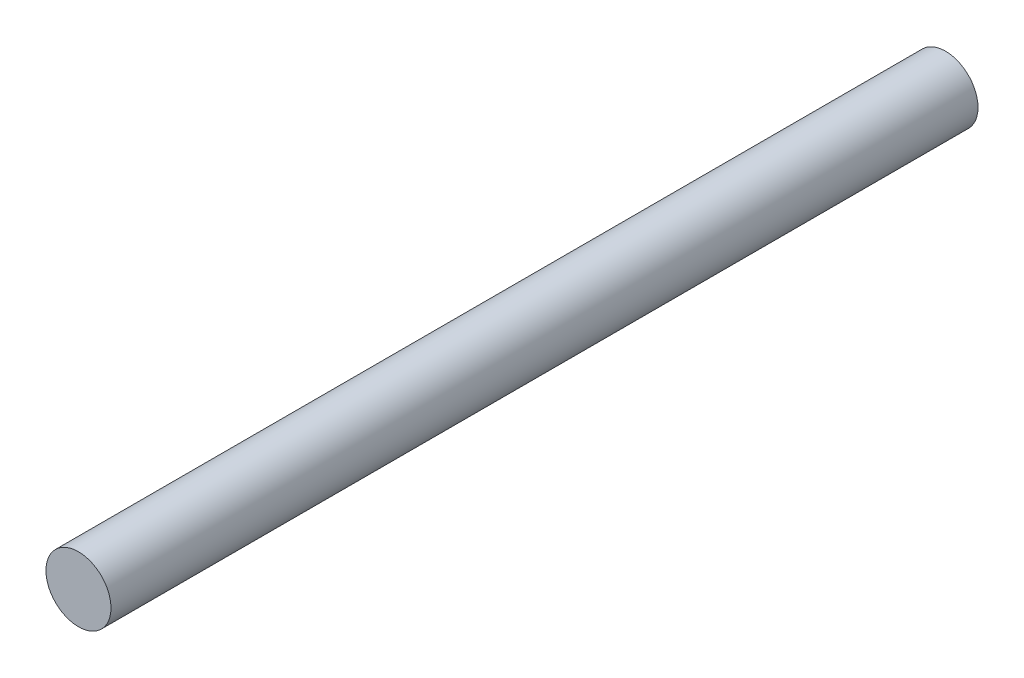
ISO-10303-21;
HEADER;
FILE_DESCRIPTION(('STEP AP214'),'2;1');
FILE_NAME('part.step','',(''),(''),'','','');
FILE_SCHEMA(('AUTOMOTIVE_DESIGN { 1 0 10303 214 1 1 1 1 }'));
ENDSEC;
DATA;
#1=APPLICATION_CONTEXT('core data for automotive mechanical design processes');
#2=APPLICATION_PROTOCOL_DEFINITION('international standard','automotive_design',2000,#1);
#3=PRODUCT_CONTEXT('',#1,'mechanical');
#4=PRODUCT('Part','Part','',(#3));
#5=PRODUCT_RELATED_PRODUCT_CATEGORY('part','',(#4));
#6=PRODUCT_DEFINITION_FORMATION('','',#4);
#7=PRODUCT_DEFINITION_CONTEXT('part definition',#1,'design');
#8=PRODUCT_DEFINITION('design','',#6,#7);
#9=PRODUCT_DEFINITION_SHAPE('','',#8);
#10=(LENGTH_UNIT() NAMED_UNIT(*) SI_UNIT(.MILLI.,.METRE.));
#11=(NAMED_UNIT(*) PLANE_ANGLE_UNIT() SI_UNIT($,.RADIAN.));
#12=(NAMED_UNIT(*) SI_UNIT($,.STERADIAN.) SOLID_ANGLE_UNIT());
#13=UNCERTAINTY_MEASURE_WITH_UNIT(LENGTH_MEASURE(1.E-05),#10,'distance_accuracy_value','');
#14=(GEOMETRIC_REPRESENTATION_CONTEXT(3) GLOBAL_UNCERTAINTY_ASSIGNED_CONTEXT((#13)) GLOBAL_UNIT_ASSIGNED_CONTEXT((#10,
#11,#12)) REPRESENTATION_CONTEXT('',''));
#15=CARTESIAN_POINT('',(0.,0.,0.));
#16=DIRECTION('',(0.,0.,1.));
#17=DIRECTION('',(1.,0.,0.));
#18=AXIS2_PLACEMENT_3D('',#15,#16,#17);
#19=CARTESIAN_POINT('',(0.,0.,120.));
#20=DIRECTION('',(0.,0.,-1.));
#21=DIRECTION('',(-1.,0.,0.));
#22=AXIS2_PLACEMENT_3D('',#19,#20,#21);
#23=CYLINDRICAL_SURFACE('',#22,4.5);
#24=CARTESIAN_POINT('',(0.,0.,120.));
#25=DIRECTION('',(0.,0.,1.));
#26=DIRECTION('',(1.,0.,0.));
#27=AXIS2_PLACEMENT_3D('',#24,#25,#26);
#28=CIRCLE('',#27,4.5);
#29=CARTESIAN_POINT('',(4.5,0.,120.));
#30=VERTEX_POINT('',#29);
#31=EDGE_CURVE('E10',#30,#30,#28,.T.);
#32=ORIENTED_EDGE('',*,*,#31,.F.);
#33=EDGE_LOOP('',(#32));
#34=FACE_BOUND('',#33,.T.);
#35=CARTESIAN_POINT('',(0.,0.,0.));
#36=DIRECTION('',(0.,0.,1.));
#37=DIRECTION('',(1.,0.,0.));
#38=AXIS2_PLACEMENT_3D('',#35,#36,#37);
#39=CIRCLE('',#38,4.5);
#40=CARTESIAN_POINT('',(4.5,0.,0.));
#41=VERTEX_POINT('',#40);
#42=EDGE_CURVE('E36',#41,#41,#39,.T.);
#43=ORIENTED_EDGE('',*,*,#42,.T.);
#44=EDGE_LOOP('',(#43));
#45=FACE_BOUND('',#44,.T.);
#46=ADVANCED_FACE('F33',(#34,#45),#23,.T.);
#47=CARTESIAN_POINT('',(0.,0.,120.));
#48=DIRECTION('',(0.,0.,1.));
#49=DIRECTION('',(1.,0.,0.));
#50=AXIS2_PLACEMENT_3D('',#47,#48,#49);
#51=PLANE('',#50);
#52=ORIENTED_EDGE('',*,*,#31,.T.);
#53=EDGE_LOOP('',(#52));
#54=FACE_BOUND('',#53,.T.);
#55=ADVANCED_FACE('F48',(#54),#51,.T.);
#56=CARTESIAN_POINT('',(0.,0.,0.));
#57=DIRECTION('',(0.,0.,1.));
#58=DIRECTION('',(1.,0.,0.));
#59=AXIS2_PLACEMENT_3D('',#56,#57,#58);
#60=PLANE('',#59);
#61=ORIENTED_EDGE('',*,*,#42,.F.);
#62=EDGE_LOOP('',(#61));
#63=FACE_BOUND('',#62,.T.);
#64=ADVANCED_FACE('F46',(#63),#60,.F.);
#65=CLOSED_SHELL('',(#46,#55,#64));
#66=MANIFOLD_SOLID_BREP('B2',#65);
#67=ADVANCED_BREP_SHAPE_REPRESENTATION('',(#18,#66),#14);
#68=SHAPE_DEFINITION_REPRESENTATION(#9,#67);
ENDSEC;
END-ISO-10303-21;
